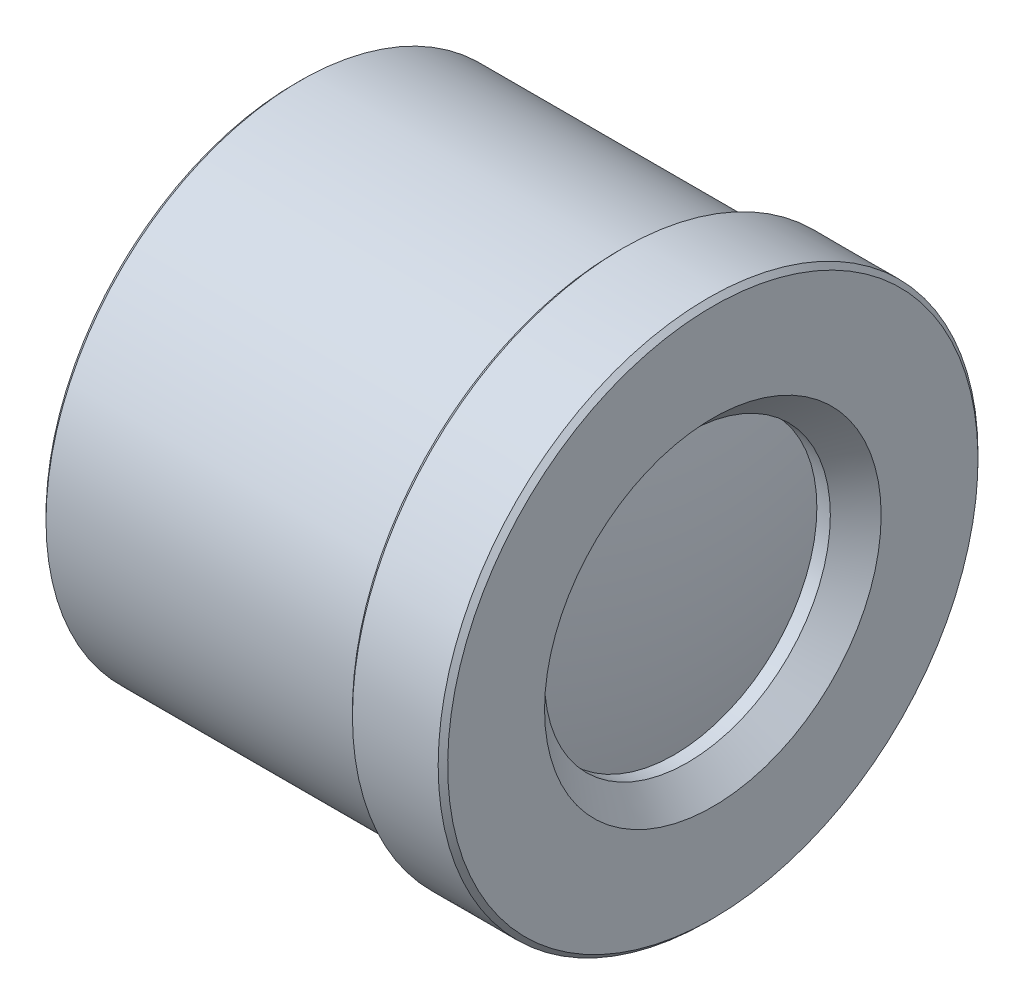
ISO-10303-21;
HEADER;
FILE_DESCRIPTION(('STEP AP214'),'2;1');
FILE_NAME('part.step','',(''),(''),'','','');
FILE_SCHEMA(('AUTOMOTIVE_DESIGN { 1 0 10303 214 1 1 1 1 }'));
ENDSEC;
DATA;
#1=APPLICATION_CONTEXT('core data for automotive mechanical design processes');
#2=APPLICATION_PROTOCOL_DEFINITION('international standard','automotive_design',2000,#1);
#3=PRODUCT_CONTEXT('',#1,'mechanical');
#4=PRODUCT('Part','Part','',(#3));
#5=PRODUCT_RELATED_PRODUCT_CATEGORY('part','',(#4));
#6=PRODUCT_DEFINITION_FORMATION('','',#4);
#7=PRODUCT_DEFINITION_CONTEXT('part definition',#1,'design');
#8=PRODUCT_DEFINITION('design','',#6,#7);
#9=PRODUCT_DEFINITION_SHAPE('','',#8);
#10=(LENGTH_UNIT() NAMED_UNIT(*) SI_UNIT(.MILLI.,.METRE.));
#11=(NAMED_UNIT(*) PLANE_ANGLE_UNIT() SI_UNIT($,.RADIAN.));
#12=(NAMED_UNIT(*) SI_UNIT($,.STERADIAN.) SOLID_ANGLE_UNIT());
#13=UNCERTAINTY_MEASURE_WITH_UNIT(LENGTH_MEASURE(1.E-05),#10,'distance_accuracy_value','');
#14=(GEOMETRIC_REPRESENTATION_CONTEXT(3) GLOBAL_UNCERTAINTY_ASSIGNED_CONTEXT((#13)) GLOBAL_UNIT_ASSIGNED_CONTEXT((#10,
#11,#12)) REPRESENTATION_CONTEXT('',''));
#15=CARTESIAN_POINT('',(0.,0.,0.));
#16=DIRECTION('',(0.,0.,1.));
#17=DIRECTION('',(1.,0.,0.));
#18=AXIS2_PLACEMENT_3D('',#15,#16,#17);
#19=CARTESIAN_POINT('',(7733.81065657801,-204.012924922708,0.));
#20=DIRECTION('',(0.,1.,0.));
#21=DIRECTION('',(1.,0.,0.));
#22=AXIS2_PLACEMENT_3D('',#19,#20,#21);
#23=SPHERICAL_SURFACE('',#22,18.9599960000004);
#24=CARTESIAN_POINT('',(7720.39717648073,-204.012924922708,0.));
#25=DIRECTION('',(-1.,0.,0.));
#26=DIRECTION('',(0.,0.,1.));
#27=AXIS2_PLACEMENT_3D('',#24,#25,#26);
#28=CIRCLE('',#27,13.4000000000017);
#29=CARTESIAN_POINT('',(7720.39717648073,-204.012924922708,13.4000000000017));
#30=VERTEX_POINT('',#29);
#31=EDGE_CURVE('E19',#30,#30,#28,.F.);
#32=ORIENTED_EDGE('',*,*,#31,.F.);
#33=EDGE_LOOP('',(#32));
#34=FACE_BOUND('',#33,.T.);
#35=ADVANCED_FACE('F15',(#34),#23,.T.);
#36=CARTESIAN_POINT('',(7709.16695200473,-204.012924922708,0.));
#37=DIRECTION('',(-1.,0.,0.));
#38=DIRECTION('',(0.,0.,1.));
#39=AXIS2_PLACEMENT_3D('',#36,#37,#38);
#40=CYLINDRICAL_SURFACE('',#39,13.4000000000017);
#41=CARTESIAN_POINT('',(7720.57479257801,-204.012924922708,0.));
#42=DIRECTION('',(-1.,0.,0.));
#43=DIRECTION('',(0.,0.,1.));
#44=AXIS2_PLACEMENT_3D('',#41,#42,#43);
#45=CIRCLE('',#44,13.400000000002);
#46=CARTESIAN_POINT('',(7720.57479257801,-204.012924922708,13.400000000002));
#47=VERTEX_POINT('',#46);
#48=EDGE_CURVE('E174',#47,#47,#45,.T.);
#49=ORIENTED_EDGE('',*,*,#48,.T.);
#50=EDGE_LOOP('',(#49));
#51=FACE_BOUND('',#50,.T.);
#52=ORIENTED_EDGE('',*,*,#31,.T.);
#53=EDGE_LOOP('',(#52));
#54=FACE_BOUND('',#53,.T.);
#55=ADVANCED_FACE('F77',(#51,#54),#40,.T.);
#56=CARTESIAN_POINT('',(7719.87479257801,-204.012924922708,0.));
#57=DIRECTION('',(-1.,0.,0.));
#58=DIRECTION('',(0.,0.,1.));
#59=AXIS2_PLACEMENT_3D('',#56,#57,#58);
#60=CONICAL_SURFACE('',#59,14.1000000000023,0.785398163397779);
#61=CARTESIAN_POINT('',(7719.87479257801,-204.012924922708,0.));
#62=DIRECTION('',(-1.,0.,0.));
#63=DIRECTION('',(0.,0.,1.));
#64=AXIS2_PLACEMENT_3D('',#61,#62,#63);
#65=CIRCLE('',#64,14.1000000000023);
#66=CARTESIAN_POINT('',(7719.87479257801,-204.012924922708,14.1000000000023));
#67=VERTEX_POINT('',#66);
#68=EDGE_CURVE('E172',#67,#67,#65,.F.);
#69=ORIENTED_EDGE('',*,*,#68,.F.);
#70=EDGE_LOOP('',(#69));
#71=FACE_BOUND('',#70,.T.);
#72=ORIENTED_EDGE('',*,*,#48,.F.);
#73=EDGE_LOOP('',(#72));
#74=FACE_BOUND('',#73,.T.);
#75=ADVANCED_FACE('F74',(#71,#74),#60,.F.);
#76=CARTESIAN_POINT('',(7719.87479257801,0.,0.));
#77=DIRECTION('',(-1.,0.,0.));
#78=DIRECTION('',(0.,0.,1.));
#79=AXIS2_PLACEMENT_3D('',#76,#77,#78);
#80=PLANE('',#79);
#81=ORIENTED_EDGE('',*,*,#68,.T.);
#82=EDGE_LOOP('',(#81));
#83=FACE_BOUND('',#82,.T.);
#84=CARTESIAN_POINT('',(7719.87479257801,-204.012924922708,0.));
#85=DIRECTION('',(-1.,0.,0.));
#86=DIRECTION('',(0.,0.,1.));
#87=AXIS2_PLACEMENT_3D('',#84,#85,#86);
#88=CIRCLE('',#87,14.5987478958807);
#89=CARTESIAN_POINT('',(7719.87479257801,-204.012924922708,14.5987478958807));
#90=VERTEX_POINT('',#89);
#91=EDGE_CURVE('E170',#90,#90,#88,.T.);
#92=ORIENTED_EDGE('',*,*,#91,.T.);
#93=EDGE_LOOP('',(#92));
#94=FACE_BOUND('',#93,.T.);
#95=ADVANCED_FACE('F70',(#83,#94),#80,.T.);
#96=CARTESIAN_POINT('',(7709.16695200473,-204.012924922708,0.));
#97=DIRECTION('',(-1.,0.,0.));
#98=DIRECTION('',(0.,0.,1.));
#99=AXIS2_PLACEMENT_3D('',#96,#97,#98);
#100=CYLINDRICAL_SURFACE('',#99,14.5987478958807);
#101=ORIENTED_EDGE('',*,*,#91,.F.);
#102=EDGE_LOOP('',(#101));
#103=FACE_BOUND('',#102,.T.);
#104=CARTESIAN_POINT('',(7719.07442391411,-204.012924922708,0.));
#105=DIRECTION('',(-1.,0.,0.));
#106=DIRECTION('',(0.,0.,1.));
#107=AXIS2_PLACEMENT_3D('',#104,#105,#106);
#108=CIRCLE('',#107,14.5987478958807);
#109=CARTESIAN_POINT('',(7719.07442391411,-204.012924922708,14.5987478958807));
#110=VERTEX_POINT('',#109);
#111=EDGE_CURVE('E167',#110,#110,#108,.T.);
#112=ORIENTED_EDGE('',*,*,#111,.T.);
#113=EDGE_LOOP('',(#112));
#114=FACE_BOUND('',#113,.T.);
#115=ADVANCED_FACE('F66',(#103,#114),#100,.F.);
#116=CARTESIAN_POINT('',(7719.07442391411,0.,0.));
#117=DIRECTION('',(-1.,0.,0.));
#118=DIRECTION('',(0.,0.,1.));
#119=AXIS2_PLACEMENT_3D('',#116,#117,#118);
#120=PLANE('',#119);
#121=CARTESIAN_POINT('',(7719.07442391411,-204.012924922708,0.));
#122=DIRECTION('',(-1.,0.,0.));
#123=DIRECTION('',(0.,0.,1.));
#124=AXIS2_PLACEMENT_3D('',#121,#122,#123);
#125=CIRCLE('',#124,14.1991652639227);
#126=CARTESIAN_POINT('',(7719.07442391411,-204.012924922708,14.1991652639227));
#127=VERTEX_POINT('',#126);
#128=EDGE_CURVE('E162',#127,#127,#125,.T.);
#129=ORIENTED_EDGE('',*,*,#128,.T.);
#130=EDGE_LOOP('',(#129));
#131=FACE_BOUND('',#130,.T.);
#132=ORIENTED_EDGE('',*,*,#111,.F.);
#133=EDGE_LOOP('',(#132));
#134=FACE_BOUND('',#133,.T.);
#135=ADVANCED_FACE('F62',(#131,#134),#120,.F.);
#136=CARTESIAN_POINT('',(7709.16695200473,-204.012924922708,0.));
#137=DIRECTION('',(-1.,0.,0.));
#138=DIRECTION('',(0.,0.,1.));
#139=AXIS2_PLACEMENT_3D('',#136,#137,#138);
#140=CYLINDRICAL_SURFACE('',#139,14.1991652639227);
#141=CARTESIAN_POINT('',(7716.87442391411,-204.012924922708,0.));
#142=DIRECTION('',(-1.,0.,0.));
#143=DIRECTION('',(0.,0.,1.));
#144=AXIS2_PLACEMENT_3D('',#141,#142,#143);
#145=CIRCLE('',#144,14.1991652639227);
#146=CARTESIAN_POINT('',(7716.87442391411,-204.012924922708,14.1991652639227));
#147=VERTEX_POINT('',#146);
#148=EDGE_CURVE('E49',#147,#147,#145,.T.);
#149=ORIENTED_EDGE('',*,*,#148,.T.);
#150=EDGE_LOOP('',(#149));
#151=FACE_BOUND('',#150,.T.);
#152=ORIENTED_EDGE('',*,*,#128,.F.);
#153=EDGE_LOOP('',(#152));
#154=FACE_BOUND('',#153,.T.);
#155=ADVANCED_FACE('F57',(#151,#154),#140,.F.);
#156=CARTESIAN_POINT('',(7690.18290257801,-204.012924922708,0.));
#157=DIRECTION('',(0.,1.,0.));
#158=DIRECTION('',(1.,0.,0.));
#159=AXIS2_PLACEMENT_3D('',#156,#157,#158);
#160=SPHERICAL_SURFACE('',#159,48.4868899999995);
#161=CARTESIAN_POINT('',(7737.82719396609,-204.012924922708,0.));
#162=DIRECTION('',(-1.,0.,0.));
#163=DIRECTION('',(0.,0.,1.));
#164=AXIS2_PLACEMENT_3D('',#161,#162,#163);
#165=CIRCLE('',#164,9.00000000000224);
#166=CARTESIAN_POINT('',(7737.82719396609,-204.012924922708,9.00000000000224));
#167=VERTEX_POINT('',#166);
#168=EDGE_CURVE('E157',#167,#167,#165,.F.);
#169=ORIENTED_EDGE('',*,*,#168,.T.);
#170=EDGE_LOOP('',(#169));
#171=FACE_BOUND('',#170,.T.);
#172=ADVANCED_FACE('F52',(#171),#160,.T.);
#173=CARTESIAN_POINT('',(7716.37442391411,-204.012924922708,0.));
#174=DIRECTION('',(-1.,0.,0.));
#175=DIRECTION('',(0.,-1.,0.));
#176=AXIS2_PLACEMENT_3D('',#173,#174,#175);
#177=CONICAL_SURFACE('',#176,14.6991652639206,0.78539816339831);
#178=CARTESIAN_POINT('',(7716.37442391411,-204.012924922708,0.));
#179=DIRECTION('',(-1.,0.,0.));
#180=DIRECTION('',(0.,-1.,0.));
#181=AXIS2_PLACEMENT_3D('',#178,#179,#180);
#182=CIRCLE('',#181,14.6991652639206);
#183=CARTESIAN_POINT('',(7716.37442391411,-218.712090186628,0.));
#184=VERTEX_POINT('',#183);
#185=EDGE_CURVE('E46',#184,#184,#182,.F.);
#186=ORIENTED_EDGE('',*,*,#185,.F.);
#187=EDGE_LOOP('',(#186));
#188=FACE_BOUND('',#187,.T.);
#189=ORIENTED_EDGE('',*,*,#148,.F.);
#190=EDGE_LOOP('',(#189));
#191=FACE_BOUND('',#190,.T.);
#192=ADVANCED_FACE('F56',(#188,#191),#177,.F.);
#193=CARTESIAN_POINT('',(7709.16695200473,-204.012924922708,0.));
#194=DIRECTION('',(-1.,0.,0.));
#195=DIRECTION('',(0.,0.,1.));
#196=AXIS2_PLACEMENT_3D('',#193,#194,#195);
#197=CYLINDRICAL_SURFACE('',#196,9.00000000000224);
#198=CARTESIAN_POINT('',(7738.67483562211,-204.012924922708,0.));
#199=DIRECTION('',(1.,0.,0.));
#200=DIRECTION('',(0.,0.,-1.));
#201=AXIS2_PLACEMENT_3D('',#198,#199,#200);
#202=CIRCLE('',#201,9.00000000000223);
#203=CARTESIAN_POINT('',(7738.67483562211,-204.012924922708,-9.00000000000223));
#204=VERTEX_POINT('',#203);
#205=EDGE_CURVE('E42',#204,#204,#202,.T.);
#206=ORIENTED_EDGE('',*,*,#205,.T.);
#207=EDGE_LOOP('',(#206));
#208=FACE_BOUND('',#207,.T.);
#209=ORIENTED_EDGE('',*,*,#168,.F.);
#210=EDGE_LOOP('',(#209));
#211=FACE_BOUND('',#210,.T.);
#212=ADVANCED_FACE('F145',(#208,#211),#197,.F.);
#213=CARTESIAN_POINT('',(7716.37442391411,0.,0.));
#214=DIRECTION('',(-1.,0.,0.));
#215=DIRECTION('',(0.,0.,1.));
#216=AXIS2_PLACEMENT_3D('',#213,#214,#215);
#217=PLANE('',#216);
#218=ORIENTED_EDGE('',*,*,#185,.T.);
#219=EDGE_LOOP('',(#218));
#220=FACE_BOUND('',#219,.T.);
#221=CARTESIAN_POINT('',(7716.37442391411,-204.012924922708,0.));
#222=DIRECTION('',(-1.,0.,0.));
#223=DIRECTION('',(0.,0.,1.));
#224=AXIS2_PLACEMENT_3D('',#221,#222,#223);
#225=CIRCLE('',#224,14.8991652639192);
#226=CARTESIAN_POINT('',(7716.37442391411,-204.012924922708,14.8991652639192));
#227=VERTEX_POINT('',#226);
#228=EDGE_CURVE('E45',#227,#227,#225,.T.);
#229=ORIENTED_EDGE('',*,*,#228,.T.);
#230=EDGE_LOOP('',(#229));
#231=FACE_BOUND('',#230,.T.);
#232=ADVANCED_FACE('F142',(#220,#231),#217,.T.);
#233=CARTESIAN_POINT('',(7740.27483562211,-204.012924922708,0.));
#234=DIRECTION('',(1.,0.,0.));
#235=DIRECTION('',(0.,0.,-1.));
#236=AXIS2_PLACEMENT_3D('',#233,#234,#235);
#237=CONICAL_SURFACE('',#236,10.5999999999983,0.785398163397652);
#238=ORIENTED_EDGE('',*,*,#205,.F.);
#239=EDGE_LOOP('',(#238));
#240=FACE_BOUND('',#239,.T.);
#241=CARTESIAN_POINT('',(7740.27483562211,-204.012924922708,0.));
#242=DIRECTION('',(1.,0.,0.));
#243=DIRECTION('',(0.,0.,-1.));
#244=AXIS2_PLACEMENT_3D('',#241,#242,#243);
#245=CIRCLE('',#244,10.5999999999983);
#246=CARTESIAN_POINT('',(7740.27483562211,-204.012924922708,-10.5999999999983));
#247=VERTEX_POINT('',#246);
#248=EDGE_CURVE('E195',#247,#247,#245,.F.);
#249=ORIENTED_EDGE('',*,*,#248,.F.);
#250=EDGE_LOOP('',(#249));
#251=FACE_BOUND('',#250,.T.);
#252=ADVANCED_FACE('F138',(#240,#251),#237,.F.);
#253=CARTESIAN_POINT('',(7709.16695200473,-204.012924922708,0.));
#254=DIRECTION('',(-1.,0.,0.));
#255=DIRECTION('',(0.,0.,1.));
#256=AXIS2_PLACEMENT_3D('',#253,#254,#255);
#257=CYLINDRICAL_SURFACE('',#256,14.8991652639192);
#258=ORIENTED_EDGE('',*,*,#228,.F.);
#259=EDGE_LOOP('',(#258));
#260=FACE_BOUND('',#259,.T.);
#261=CARTESIAN_POINT('',(7715.97484128215,-204.012924922708,0.));
#262=DIRECTION('',(-1.,0.,0.));
#263=DIRECTION('',(0.,0.,1.));
#264=AXIS2_PLACEMENT_3D('',#261,#262,#263);
#265=CIRCLE('',#264,14.8991652639192);
#266=CARTESIAN_POINT('',(7715.97484128215,-204.012924922708,14.8991652639192));
#267=VERTEX_POINT('',#266);
#268=EDGE_CURVE('E192',#267,#267,#265,.T.);
#269=ORIENTED_EDGE('',*,*,#268,.T.);
#270=EDGE_LOOP('',(#269));
#271=FACE_BOUND('',#270,.T.);
#272=ADVANCED_FACE('F134',(#260,#271),#257,.F.);
#273=CARTESIAN_POINT('',(7740.27483562211,1.12701564570863E-09,0.));
#274=DIRECTION('',(1.,0.,0.));
#275=DIRECTION('',(0.,0.,-1.));
#276=AXIS2_PLACEMENT_3D('',#273,#274,#275);
#277=PLANE('',#276);
#278=CARTESIAN_POINT('',(7740.27483562211,-204.012924922708,0.));
#279=DIRECTION('',(-1.,0.,0.));
#280=DIRECTION('',(0.,-1.,0.));
#281=AXIS2_PLACEMENT_3D('',#278,#279,#280);
#282=CIRCLE('',#281,16.6999553091576);
#283=CARTESIAN_POINT('',(7740.27483562211,-220.712880231865,0.));
#284=VERTEX_POINT('',#283);
#285=EDGE_CURVE('E189',#284,#284,#282,.T.);
#286=ORIENTED_EDGE('',*,*,#285,.F.);
#287=EDGE_LOOP('',(#286));
#288=FACE_BOUND('',#287,.T.);
#289=ORIENTED_EDGE('',*,*,#248,.T.);
#290=EDGE_LOOP('',(#289));
#291=FACE_BOUND('',#290,.T.);
#292=ADVANCED_FACE('F130',(#288,#291),#277,.T.);
#293=CARTESIAN_POINT('',(7715.97484128215,0.,0.));
#294=DIRECTION('',(-1.,0.,0.));
#295=DIRECTION('',(0.,0.,1.));
#296=AXIS2_PLACEMENT_3D('',#293,#294,#295);
#297=PLANE('',#296);
#298=CARTESIAN_POINT('',(7715.97484128215,-204.012924922708,0.));
#299=DIRECTION('',(-1.,0.,0.));
#300=DIRECTION('',(0.,0.,1.));
#301=AXIS2_PLACEMENT_3D('',#298,#299,#300);
#302=CIRCLE('',#301,14.4995826319607);
#303=CARTESIAN_POINT('',(7715.97484128215,-204.012924922708,14.4995826319607));
#304=VERTEX_POINT('',#303);
#305=EDGE_CURVE('E41',#304,#304,#302,.T.);
#306=ORIENTED_EDGE('',*,*,#305,.T.);
#307=EDGE_LOOP('',(#306));
#308=FACE_BOUND('',#307,.T.);
#309=ORIENTED_EDGE('',*,*,#268,.F.);
#310=EDGE_LOOP('',(#309));
#311=FACE_BOUND('',#310,.T.);
#312=ADVANCED_FACE('F126',(#308,#311),#297,.F.);
#313=CARTESIAN_POINT('',(7739.97481552742,-204.012924922708,0.));
#314=DIRECTION('',(-1.,0.,0.));
#315=DIRECTION('',(0.,-1.,0.));
#316=AXIS2_PLACEMENT_3D('',#313,#314,#315);
#317=CONICAL_SURFACE('',#316,16.9999697410215,0.78538872590499);
#318=ORIENTED_EDGE('',*,*,#285,.T.);
#319=EDGE_LOOP('',(#318));
#320=FACE_BOUND('',#319,.T.);
#321=CARTESIAN_POINT('',(7739.97481552743,-204.012924922708,0.));
#322=DIRECTION('',(-1.,0.,0.));
#323=DIRECTION('',(1.04491764777313E-13,0.,1.));
#324=AXIS2_PLACEMENT_3D('',#321,#322,#323);
#325=CIRCLE('',#324,16.9999697410215);
#326=CARTESIAN_POINT('',(7739.97481552743,-204.012924922708,16.9999697410215));
#327=VERTEX_POINT('',#326);
#328=EDGE_CURVE('E38',#327,#327,#325,.T.);
#329=ORIENTED_EDGE('',*,*,#328,.F.);
#330=EDGE_LOOP('',(#329));
#331=FACE_BOUND('',#330,.T.);
#332=ADVANCED_FACE('F122',(#320,#331),#317,.T.);
#333=CARTESIAN_POINT('',(7709.16695200473,-204.012924922708,0.));
#334=DIRECTION('',(-1.,0.,0.));
#335=DIRECTION('',(0.,0.,1.));
#336=AXIS2_PLACEMENT_3D('',#333,#334,#335);
#337=CYLINDRICAL_SURFACE('',#336,14.4995826319607);
#338=ORIENTED_EDGE('',*,*,#305,.F.);
#339=EDGE_LOOP('',(#338));
#340=FACE_BOUND('',#339,.T.);
#341=CARTESIAN_POINT('',(7714.27484128215,-204.012924922708,0.));
#342=DIRECTION('',(-1.,0.,0.));
#343=DIRECTION('',(0.,0.,1.));
#344=AXIS2_PLACEMENT_3D('',#341,#342,#343);
#345=CIRCLE('',#344,14.4995826319607);
#346=CARTESIAN_POINT('',(7714.27484128215,-204.012924922708,14.4995826319607));
#347=VERTEX_POINT('',#346);
#348=EDGE_CURVE('E35',#347,#347,#345,.T.);
#349=ORIENTED_EDGE('',*,*,#348,.T.);
#350=EDGE_LOOP('',(#349));
#351=FACE_BOUND('',#350,.T.);
#352=ADVANCED_FACE('F118',(#340,#351),#337,.F.);
#353=CARTESIAN_POINT('',(7734.57481554326,-204.012924922708,0.));
#354=DIRECTION('',(-1.,0.,0.));
#355=DIRECTION('',(0.,0.,1.));
#356=AXIS2_PLACEMENT_3D('',#353,#354,#355);
#357=CONICAL_SURFACE('',#356,17.0002295266483,4.81084495040089E-05);
#358=ORIENTED_EDGE('',*,*,#328,.T.);
#359=EDGE_LOOP('',(#358));
#360=FACE_BOUND('',#359,.T.);
#361=CARTESIAN_POINT('',(7734.57481554327,-204.012924922708,0.));
#362=DIRECTION('',(1.,0.,0.));
#363=DIRECTION('',(0.,0.,-1.));
#364=AXIS2_PLACEMENT_3D('',#361,#362,#363);
#365=CIRCLE('',#364,17.0002295266483);
#366=CARTESIAN_POINT('',(7734.57481554327,-204.012924922708,-17.0002295266483));
#367=VERTEX_POINT('',#366);
#368=EDGE_CURVE('E31',#367,#367,#365,.F.);
#369=ORIENTED_EDGE('',*,*,#368,.F.);
#370=EDGE_LOOP('',(#369));
#371=FACE_BOUND('',#370,.T.);
#372=ADVANCED_FACE('F114',(#360,#371),#357,.T.);
#373=CARTESIAN_POINT('',(7713.97484128215,-204.012924922708,0.));
#374=DIRECTION('',(-1.,0.,0.));
#375=DIRECTION('',(0.,0.,1.));
#376=AXIS2_PLACEMENT_3D('',#373,#374,#375);
#377=CONICAL_SURFACE('',#376,14.7995826319618,0.785398163398932);
#378=ORIENTED_EDGE('',*,*,#348,.F.);
#379=EDGE_LOOP('',(#378));
#380=FACE_BOUND('',#379,.T.);
#381=CARTESIAN_POINT('',(7713.97484128215,-204.012924922708,0.));
#382=DIRECTION('',(-1.,0.,0.));
#383=DIRECTION('',(0.,0.,1.));
#384=AXIS2_PLACEMENT_3D('',#381,#382,#383);
#385=CIRCLE('',#384,14.7995826319618);
#386=CARTESIAN_POINT('',(7713.97484128215,-204.012924922708,14.7995826319618));
#387=VERTEX_POINT('',#386);
#388=EDGE_CURVE('E34',#387,#387,#385,.T.);
#389=ORIENTED_EDGE('',*,*,#388,.T.);
#390=EDGE_LOOP('',(#389));
#391=FACE_BOUND('',#390,.T.);
#392=ADVANCED_FACE('F110',(#380,#391),#377,.F.);
#393=CARTESIAN_POINT('',(7734.57481554327,-204.012924922708,0.));
#394=DIRECTION('',(1.,0.,0.));
#395=DIRECTION('',(0.,0.,-1.));
#396=AXIS2_PLACEMENT_3D('',#393,#394,#395);
#397=CONICAL_SURFACE('',#396,17.0002295266483,0.78540759929756);
#398=CARTESIAN_POINT('',(7734.27483563769,-204.012924922708,0.));
#399=DIRECTION('',(1.,0.,0.));
#400=DIRECTION('',(0.,0.,-1.));
#401=AXIS2_PLACEMENT_3D('',#398,#399,#400);
#402=CIRCLE('',#401,16.7002439598542);
#403=CARTESIAN_POINT('',(7734.27483563769,-204.012924922708,-16.7002439598542));
#404=VERTEX_POINT('',#403);
#405=EDGE_CURVE('E182',#404,#404,#402,.T.);
#406=ORIENTED_EDGE('',*,*,#405,.T.);
#407=EDGE_LOOP('',(#406));
#408=FACE_BOUND('',#407,.T.);
#409=ORIENTED_EDGE('',*,*,#368,.T.);
#410=EDGE_LOOP('',(#409));
#411=FACE_BOUND('',#410,.T.);
#412=ADVANCED_FACE('F106',(#408,#411),#397,.T.);
#413=CARTESIAN_POINT('',(7713.97484128215,0.,0.));
#414=DIRECTION('',(1.,0.,0.));
#415=DIRECTION('',(0.,0.,-1.));
#416=AXIS2_PLACEMENT_3D('',#413,#414,#415);
#417=PLANE('',#416);
#418=CARTESIAN_POINT('',(7713.97484128215,-204.012924922708,0.));
#419=DIRECTION('',(1.,0.,0.));
#420=DIRECTION('',(0.,0.,-1.));
#421=AXIS2_PLACEMENT_3D('',#418,#419,#420);
#422=CIRCLE('',#421,15.6995826319614);
#423=CARTESIAN_POINT('',(7713.97484128215,-204.012924922708,-15.6995826319614));
#424=VERTEX_POINT('',#423);
#425=EDGE_CURVE('E28',#424,#424,#422,.T.);
#426=ORIENTED_EDGE('',*,*,#425,.F.);
#427=EDGE_LOOP('',(#426));
#428=FACE_BOUND('',#427,.T.);
#429=ORIENTED_EDGE('',*,*,#388,.F.);
#430=EDGE_LOOP('',(#429));
#431=FACE_BOUND('',#430,.T.);
#432=ADVANCED_FACE('F102',(#428,#431),#417,.F.);
#433=CARTESIAN_POINT('',(7734.27483563769,0.,0.));
#434=DIRECTION('',(1.,0.,0.));
#435=DIRECTION('',(0.,0.,-1.));
#436=AXIS2_PLACEMENT_3D('',#433,#434,#435);
#437=PLANE('',#436);
#438=ORIENTED_EDGE('',*,*,#405,.F.);
#439=EDGE_LOOP('',(#438));
#440=FACE_BOUND('',#439,.T.);
#441=CARTESIAN_POINT('',(7734.27483563769,-204.012924922708,0.));
#442=DIRECTION('',(-1.,0.,0.));
#443=DIRECTION('',(0.,0.,1.));
#444=AXIS2_PLACEMENT_3D('',#441,#442,#443);
#445=CIRCLE('',#444,15.9995826319661);
#446=CARTESIAN_POINT('',(7734.27483563769,-204.012924922708,15.9995826319661));
#447=VERTEX_POINT('',#446);
#448=EDGE_CURVE('E23',#447,#447,#445,.T.);
#449=ORIENTED_EDGE('',*,*,#448,.F.);
#450=EDGE_LOOP('',(#449));
#451=FACE_BOUND('',#450,.T.);
#452=ADVANCED_FACE('F96',(#440,#451),#437,.F.);
#453=CARTESIAN_POINT('',(7714.27484128215,-204.012924922708,0.));
#454=DIRECTION('',(1.,0.,0.));
#455=DIRECTION('',(0.,0.,-1.));
#456=AXIS2_PLACEMENT_3D('',#453,#454,#455);
#457=CONICAL_SURFACE('',#456,15.9995826319625,0.785398163398934);
#458=CARTESIAN_POINT('',(7714.27484128215,-204.012924922708,0.));
#459=DIRECTION('',(-1.,0.,0.));
#460=DIRECTION('',(0.,0.,1.));
#461=AXIS2_PLACEMENT_3D('',#458,#459,#460);
#462=CIRCLE('',#461,15.9995826319661);
#463=CARTESIAN_POINT('',(7714.27484128215,-204.012924922708,15.9995826319661));
#464=VERTEX_POINT('',#463);
#465=EDGE_CURVE('E9',#464,#464,#462,.F.);
#466=ORIENTED_EDGE('',*,*,#465,.F.);
#467=EDGE_LOOP('',(#466));
#468=FACE_BOUND('',#467,.T.);
#469=ORIENTED_EDGE('',*,*,#425,.T.);
#470=EDGE_LOOP('',(#469));
#471=FACE_BOUND('',#470,.T.);
#472=ADVANCED_FACE('F90',(#468,#471),#457,.T.);
#473=CARTESIAN_POINT('',(7709.16695200473,-204.012924922708,0.));
#474=DIRECTION('',(-1.,0.,0.));
#475=DIRECTION('',(0.,0.,1.));
#476=AXIS2_PLACEMENT_3D('',#473,#474,#475);
#477=CYLINDRICAL_SURFACE('',#476,15.9995826319661);
#478=ORIENTED_EDGE('',*,*,#448,.T.);
#479=EDGE_LOOP('',(#478));
#480=FACE_BOUND('',#479,.T.);
#481=ORIENTED_EDGE('',*,*,#465,.T.);
#482=EDGE_LOOP('',(#481));
#483=FACE_BOUND('',#482,.T.);
#484=ADVANCED_FACE('F88',(#480,#483),#477,.T.);
#485=CLOSED_SHELL('',(#35,#55,#75,#95,#115,#135,#155,#172,#192,#212,#232,#252,#272,#292,#312,
#332,#352,#372,#392,#412,#432,#452,#472,#484));
#486=MANIFOLD_SOLID_BREP('B1',#485);
#487=ADVANCED_BREP_SHAPE_REPRESENTATION('',(#18,#486),#14);
#488=SHAPE_DEFINITION_REPRESENTATION(#9,#487);
ENDSEC;
END-ISO-10303-21;
